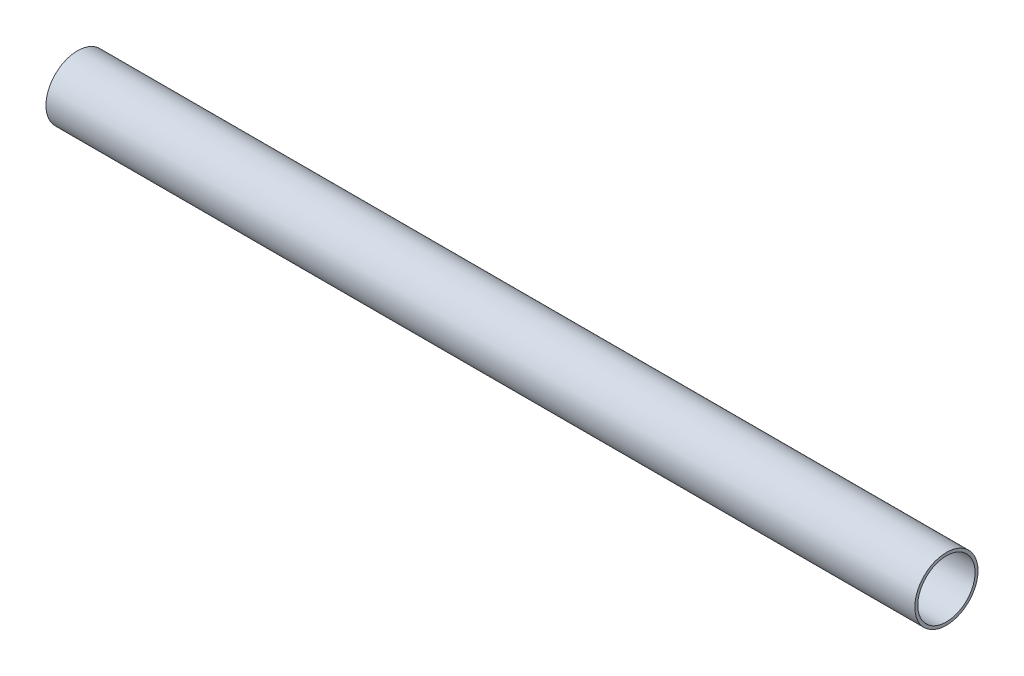
ISO-10303-21;
HEADER;
FILE_DESCRIPTION(('STEP AP214'),'2;1');
FILE_NAME('part.step','',(''),(''),'','','');
FILE_SCHEMA(('AUTOMOTIVE_DESIGN { 1 0 10303 214 1 1 1 1 }'));
ENDSEC;
DATA;
#1=APPLICATION_CONTEXT('core data for automotive mechanical design processes');
#2=APPLICATION_PROTOCOL_DEFINITION('international standard','automotive_design',2000,#1);
#3=PRODUCT_CONTEXT('',#1,'mechanical');
#4=PRODUCT('Part','Part','',(#3));
#5=PRODUCT_RELATED_PRODUCT_CATEGORY('part','',(#4));
#6=PRODUCT_DEFINITION_FORMATION('','',#4);
#7=PRODUCT_DEFINITION_CONTEXT('part definition',#1,'design');
#8=PRODUCT_DEFINITION('design','',#6,#7);
#9=PRODUCT_DEFINITION_SHAPE('','',#8);
#10=(LENGTH_UNIT() NAMED_UNIT(*) SI_UNIT(.MILLI.,.METRE.));
#11=(NAMED_UNIT(*) PLANE_ANGLE_UNIT() SI_UNIT($,.RADIAN.));
#12=(NAMED_UNIT(*) SI_UNIT($,.STERADIAN.) SOLID_ANGLE_UNIT());
#13=UNCERTAINTY_MEASURE_WITH_UNIT(LENGTH_MEASURE(1.E-05),#10,'distance_accuracy_value','');
#14=(GEOMETRIC_REPRESENTATION_CONTEXT(3) GLOBAL_UNCERTAINTY_ASSIGNED_CONTEXT((#13)) GLOBAL_UNIT_ASSIGNED_CONTEXT((#10,
#11,#12)) REPRESENTATION_CONTEXT('',''));
#15=CARTESIAN_POINT('',(0.,0.,0.));
#16=DIRECTION('',(0.,0.,1.));
#17=DIRECTION('',(1.,0.,0.));
#18=AXIS2_PLACEMENT_3D('',#15,#16,#17);
#19=CARTESIAN_POINT('',(0.,0.,0.));
#20=DIRECTION('',(1.,0.,0.));
#21=DIRECTION('',(0.,0.,-1.));
#22=AXIS2_PLACEMENT_3D('',#19,#20,#21);
#23=CYLINDRICAL_SURFACE('',#22,8.);
#24=CARTESIAN_POINT('',(0.,0.,0.));
#25=DIRECTION('',(1.,0.,0.));
#26=DIRECTION('',(0.,0.,-1.));
#27=AXIS2_PLACEMENT_3D('',#24,#25,#26);
#28=CIRCLE('',#27,8.);
#29=CARTESIAN_POINT('',(0.,0.,-8.));
#30=VERTEX_POINT('',#29);
#31=EDGE_CURVE('E10',#30,#30,#28,.T.);
#32=ORIENTED_EDGE('',*,*,#31,.T.);
#33=EDGE_LOOP('',(#32));
#34=FACE_BOUND('',#33,.T.);
#35=CARTESIAN_POINT('',(220.,0.,0.));
#36=DIRECTION('',(1.,0.,0.));
#37=DIRECTION('',(0.,0.,-1.));
#38=AXIS2_PLACEMENT_3D('',#35,#36,#37);
#39=CIRCLE('',#38,8.);
#40=CARTESIAN_POINT('',(220.,0.,-8.));
#41=VERTEX_POINT('',#40);
#42=EDGE_CURVE('E45',#41,#41,#39,.T.);
#43=ORIENTED_EDGE('',*,*,#42,.F.);
#44=EDGE_LOOP('',(#43));
#45=FACE_BOUND('',#44,.T.);
#46=ADVANCED_FACE('F31',(#34,#45),#23,.T.);
#47=CARTESIAN_POINT('',(0.,8.,0.));
#48=DIRECTION('',(-1.,0.,0.));
#49=DIRECTION('',(0.,0.,1.));
#50=AXIS2_PLACEMENT_3D('',#47,#48,#49);
#51=PLANE('',#50);
#52=CARTESIAN_POINT('',(0.,0.,0.));
#53=DIRECTION('',(1.,0.,0.));
#54=DIRECTION('',(0.,0.,-1.));
#55=AXIS2_PLACEMENT_3D('',#52,#53,#54);
#56=CIRCLE('',#55,7.25);
#57=CARTESIAN_POINT('',(0.,0.,-7.25));
#58=VERTEX_POINT('',#57);
#59=EDGE_CURVE('E37',#58,#58,#56,.T.);
#60=ORIENTED_EDGE('',*,*,#59,.T.);
#61=EDGE_LOOP('',(#60));
#62=FACE_BOUND('',#61,.T.);
#63=ORIENTED_EDGE('',*,*,#31,.F.);
#64=EDGE_LOOP('',(#63));
#65=FACE_BOUND('',#64,.T.);
#66=ADVANCED_FACE('F55',(#62,#65),#51,.T.);
#67=CARTESIAN_POINT('',(0.,0.,0.));
#68=DIRECTION('',(1.,0.,0.));
#69=DIRECTION('',(0.,0.,-1.));
#70=AXIS2_PLACEMENT_3D('',#67,#68,#69);
#71=CYLINDRICAL_SURFACE('',#70,7.25);
#72=CARTESIAN_POINT('',(220.,0.,0.));
#73=DIRECTION('',(1.,0.,0.));
#74=DIRECTION('',(0.,0.,-1.));
#75=AXIS2_PLACEMENT_3D('',#72,#73,#74);
#76=CIRCLE('',#75,7.25);
#77=CARTESIAN_POINT('',(220.,0.,-7.25));
#78=VERTEX_POINT('',#77);
#79=EDGE_CURVE('E41',#78,#78,#76,.T.);
#80=ORIENTED_EDGE('',*,*,#79,.T.);
#81=EDGE_LOOP('',(#80));
#82=FACE_BOUND('',#81,.T.);
#83=ORIENTED_EDGE('',*,*,#59,.F.);
#84=EDGE_LOOP('',(#83));
#85=FACE_BOUND('',#84,.T.);
#86=ADVANCED_FACE('F59',(#82,#85),#71,.F.);
#87=CARTESIAN_POINT('',(220.,7.25,0.));
#88=DIRECTION('',(1.,0.,0.));
#89=DIRECTION('',(0.,0.,-1.));
#90=AXIS2_PLACEMENT_3D('',#87,#88,#89);
#91=PLANE('',#90);
#92=ORIENTED_EDGE('',*,*,#42,.T.);
#93=EDGE_LOOP('',(#92));
#94=FACE_BOUND('',#93,.T.);
#95=ORIENTED_EDGE('',*,*,#79,.F.);
#96=EDGE_LOOP('',(#95));
#97=FACE_BOUND('',#96,.T.);
#98=ADVANCED_FACE('F51',(#94,#97),#91,.T.);
#99=CLOSED_SHELL('',(#46,#66,#86,#98));
#100=MANIFOLD_SOLID_BREP('B2',#99);
#101=ADVANCED_BREP_SHAPE_REPRESENTATION('',(#18,#100),#14);
#102=SHAPE_DEFINITION_REPRESENTATION(#9,#101);
ENDSEC;
END-ISO-10303-21;
